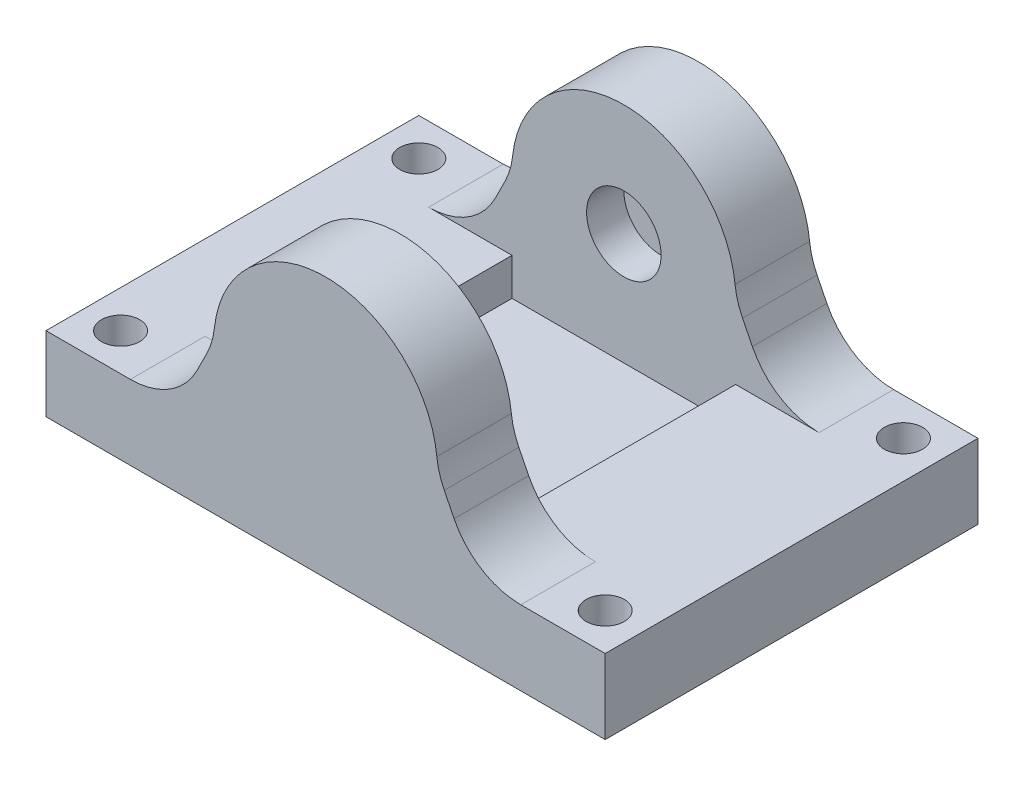
ISO-10303-21;
HEADER;
FILE_DESCRIPTION(('STEP AP214'),'2;1');
FILE_NAME('part.step','',(''),(''),'','','');
FILE_SCHEMA(('AUTOMOTIVE_DESIGN { 1 0 10303 214 1 1 1 1 }'));
ENDSEC;
DATA;
#1=APPLICATION_CONTEXT('core data for automotive mechanical design processes');
#2=APPLICATION_PROTOCOL_DEFINITION('international standard','automotive_design',2000,#1);
#3=PRODUCT_CONTEXT('',#1,'mechanical');
#4=PRODUCT('Part','Part','',(#3));
#5=PRODUCT_RELATED_PRODUCT_CATEGORY('part','',(#4));
#6=PRODUCT_DEFINITION_FORMATION('','',#4);
#7=PRODUCT_DEFINITION_CONTEXT('part definition',#1,'design');
#8=PRODUCT_DEFINITION('design','',#6,#7);
#9=PRODUCT_DEFINITION_SHAPE('','',#8);
#10=(LENGTH_UNIT() NAMED_UNIT(*) SI_UNIT(.MILLI.,.METRE.));
#11=(NAMED_UNIT(*) PLANE_ANGLE_UNIT() SI_UNIT($,.RADIAN.));
#12=(NAMED_UNIT(*) SI_UNIT($,.STERADIAN.) SOLID_ANGLE_UNIT());
#13=UNCERTAINTY_MEASURE_WITH_UNIT(LENGTH_MEASURE(1.E-05),#10,'distance_accuracy_value','');
#14=(GEOMETRIC_REPRESENTATION_CONTEXT(3) GLOBAL_UNCERTAINTY_ASSIGNED_CONTEXT((#13)) GLOBAL_UNIT_ASSIGNED_CONTEXT((#10,
#11,#12)) REPRESENTATION_CONTEXT('',''));
#15=CARTESIAN_POINT('',(0.,0.,0.));
#16=DIRECTION('',(0.,0.,1.));
#17=DIRECTION('',(1.,0.,0.));
#18=AXIS2_PLACEMENT_3D('',#15,#16,#17);
#19=CARTESIAN_POINT('',(0.,10.,0.));
#20=DIRECTION('',(0.,1.,0.));
#21=DIRECTION('',(0.,0.,1.));
#22=AXIS2_PLACEMENT_3D('',#19,#20,#21);
#23=PLANE('',#22);
#24=DIRECTION('',(0.,0.,1.));
#25=VECTOR('',#24,1.);
#26=CARTESIAN_POINT('',(22.5,10.,-40.));
#27=LINE('',#26,#25);
#28=CARTESIAN_POINT('',(22.5,10.,-40.));
#29=VERTEX_POINT('',#28);
#30=CARTESIAN_POINT('',(22.5,10.,-10.));
#31=VERTEX_POINT('',#30);
#32=EDGE_CURVE('E205',#29,#31,#27,.T.);
#33=ORIENTED_EDGE('',*,*,#32,.F.);
#34=DIRECTION('',(1.,0.,0.));
#35=VECTOR('',#34,1.);
#36=CARTESIAN_POINT('',(17.5,10.,-40.));
#37=LINE('',#36,#35);
#38=CARTESIAN_POINT('',(11.319660112501,10.,-40.));
#39=VERTEX_POINT('',#38);
#40=EDGE_CURVE('E272',#39,#29,#37,.T.);
#41=ORIENTED_EDGE('',*,*,#40,.F.);
#42=DIRECTION('',(0.,0.,-1.));
#43=VECTOR('',#42,1.);
#44=CARTESIAN_POINT('',(11.319660112501,10.,0.));
#45=LINE('',#44,#43);
#46=CARTESIAN_POINT('',(11.319660112501,10.,-50.));
#47=VERTEX_POINT('',#46);
#48=EDGE_CURVE('E387',#39,#47,#45,.T.);
#49=ORIENTED_EDGE('',*,*,#48,.T.);
#50=DIRECTION('',(1.,0.,0.));
#51=VECTOR('',#50,1.);
#52=CARTESIAN_POINT('',(0.,10.,-50.));
#53=LINE('',#52,#51);
#54=CARTESIAN_POINT('',(0.,10.,-50.));
#55=VERTEX_POINT('',#54);
#56=EDGE_CURVE('E320',#55,#47,#53,.T.);
#57=ORIENTED_EDGE('',*,*,#56,.F.);
#58=DIRECTION('',(0.,0.,-1.));
#59=VECTOR('',#58,1.);
#60=CARTESIAN_POINT('',(0.,10.,0.));
#61=LINE('',#60,#59);
#62=CARTESIAN_POINT('',(0.,10.,0.));
#63=VERTEX_POINT('',#62);
#64=EDGE_CURVE('E323',#63,#55,#61,.T.);
#65=ORIENTED_EDGE('',*,*,#64,.F.);
#66=DIRECTION('',(1.,0.,0.));
#67=VECTOR('',#66,1.);
#68=CARTESIAN_POINT('',(0.,10.,0.));
#69=LINE('',#68,#67);
#70=CARTESIAN_POINT('',(11.319660112501,10.,0.));
#71=VERTEX_POINT('',#70);
#72=EDGE_CURVE('E312',#63,#71,#69,.T.);
#73=ORIENTED_EDGE('',*,*,#72,.T.);
#74=DIRECTION('',(0.,0.,1.));
#75=VECTOR('',#74,1.);
#76=CARTESIAN_POINT('',(11.319660112501,10.,-10.));
#77=LINE('',#76,#75);
#78=CARTESIAN_POINT('',(11.319660112501,10.,-10.));
#79=VERTEX_POINT('',#78);
#80=EDGE_CURVE('E354',#71,#79,#77,.F.);
#81=ORIENTED_EDGE('',*,*,#80,.T.);
#82=DIRECTION('',(1.,0.,0.));
#83=VECTOR('',#82,1.);
#84=CARTESIAN_POINT('',(17.5,10.,-10.));
#85=LINE('',#84,#83);
#86=EDGE_CURVE('E299',#79,#31,#85,.T.);
#87=ORIENTED_EDGE('',*,*,#86,.T.);
#88=EDGE_LOOP('',(#33,#41,#49,#57,#65,#73,#81,#87));
#89=FACE_BOUND('',#88,.T.);
#90=CARTESIAN_POINT('',(5.,10.,-5.));
#91=DIRECTION('',(0.,1.,0.));
#92=DIRECTION('',(0.,0.,1.));
#93=AXIS2_PLACEMENT_3D('',#90,#91,#92);
#94=CIRCLE('',#93,2.5625);
#95=CARTESIAN_POINT('',(5.,10.,-2.4375));
#96=VERTEX_POINT('',#95);
#97=EDGE_CURVE('E250',#96,#96,#94,.T.);
#98=ORIENTED_EDGE('',*,*,#97,.F.);
#99=EDGE_LOOP('',(#98));
#100=FACE_BOUND('',#99,.T.);
#101=CARTESIAN_POINT('',(5.,10.,-45.));
#102=DIRECTION('',(0.,-1.,0.));
#103=DIRECTION('',(0.,0.,-1.));
#104=AXIS2_PLACEMENT_3D('',#101,#102,#103);
#105=CIRCLE('',#104,2.5625);
#106=CARTESIAN_POINT('',(5.,10.,-47.5625));
#107=VERTEX_POINT('',#106);
#108=EDGE_CURVE('E244',#107,#107,#105,.T.);
#109=ORIENTED_EDGE('',*,*,#108,.T.);
#110=EDGE_LOOP('',(#109));
#111=FACE_BOUND('',#110,.T.);
#112=ADVANCED_FACE('F36',(#89,#100,#111),#23,.T.);
#113=DIRECTION('',(0.,0.,-1.));
#114=VECTOR('',#113,1.);
#115=CARTESIAN_POINT('',(52.5,10.,-40.));
#116=LINE('',#115,#114);
#117=CARTESIAN_POINT('',(52.5,10.,-10.));
#118=VERTEX_POINT('',#117);
#119=CARTESIAN_POINT('',(52.5,10.,-40.));
#120=VERTEX_POINT('',#119);
#121=EDGE_CURVE('E51',#118,#120,#116,.T.);
#122=ORIENTED_EDGE('',*,*,#121,.F.);
#123=CARTESIAN_POINT('',(63.680339887499,10.,-10.));
#124=VERTEX_POINT('',#123);
#125=EDGE_CURVE('E298',#118,#124,#85,.T.);
#126=ORIENTED_EDGE('',*,*,#125,.T.);
#127=DIRECTION('',(0.,0.,1.));
#128=VECTOR('',#127,1.);
#129=CARTESIAN_POINT('',(63.680339887499,10.,0.));
#130=LINE('',#129,#128);
#131=CARTESIAN_POINT('',(63.680339887499,10.,0.));
#132=VERTEX_POINT('',#131);
#133=EDGE_CURVE('E351',#124,#132,#130,.T.);
#134=ORIENTED_EDGE('',*,*,#133,.T.);
#135=CARTESIAN_POINT('',(75.,10.,0.));
#136=VERTEX_POINT('',#135);
#137=EDGE_CURVE('E316',#132,#136,#69,.T.);
#138=ORIENTED_EDGE('',*,*,#137,.T.);
#139=DIRECTION('',(0.,0.,-1.));
#140=VECTOR('',#139,1.);
#141=CARTESIAN_POINT('',(75.,10.,0.));
#142=LINE('',#141,#140);
#143=CARTESIAN_POINT('',(75.,10.,-50.));
#144=VERTEX_POINT('',#143);
#145=EDGE_CURVE('E315',#136,#144,#142,.T.);
#146=ORIENTED_EDGE('',*,*,#145,.T.);
#147=CARTESIAN_POINT('',(63.6803398874989,10.,-50.));
#148=VERTEX_POINT('',#147);
#149=EDGE_CURVE('E319',#148,#144,#53,.T.);
#150=ORIENTED_EDGE('',*,*,#149,.F.);
#151=DIRECTION('',(0.,0.,-1.));
#152=VECTOR('',#151,1.);
#153=CARTESIAN_POINT('',(63.6803398874989,10.,0.));
#154=LINE('',#153,#152);
#155=CARTESIAN_POINT('',(63.6803398874989,10.,-40.));
#156=VERTEX_POINT('',#155);
#157=EDGE_CURVE('E384',#148,#156,#154,.F.);
#158=ORIENTED_EDGE('',*,*,#157,.T.);
#159=EDGE_CURVE('E271',#120,#156,#37,.T.);
#160=ORIENTED_EDGE('',*,*,#159,.F.);
#161=EDGE_LOOP('',(#122,#126,#134,#138,#146,#150,#158,#160));
#162=FACE_BOUND('',#161,.T.);
#163=CARTESIAN_POINT('',(70.,10.,-45.));
#164=DIRECTION('',(0.,1.,0.));
#165=DIRECTION('',(0.,0.,-1.));
#166=AXIS2_PLACEMENT_3D('',#163,#164,#165);
#167=CIRCLE('',#166,2.5625);
#168=CARTESIAN_POINT('',(70.,10.,-47.5625));
#169=VERTEX_POINT('',#168);
#170=EDGE_CURVE('E231',#169,#169,#167,.T.);
#171=ORIENTED_EDGE('',*,*,#170,.F.);
#172=EDGE_LOOP('',(#171));
#173=FACE_BOUND('',#172,.T.);
#174=CARTESIAN_POINT('',(70.,10.,-5.));
#175=DIRECTION('',(0.,-1.,0.));
#176=DIRECTION('',(0.,0.,1.));
#177=AXIS2_PLACEMENT_3D('',#174,#175,#176);
#178=CIRCLE('',#177,2.5625);
#179=CARTESIAN_POINT('',(70.,10.,-2.4375));
#180=VERTEX_POINT('',#179);
#181=EDGE_CURVE('E238',#180,#180,#178,.T.);
#182=ORIENTED_EDGE('',*,*,#181,.T.);
#183=EDGE_LOOP('',(#182));
#184=FACE_BOUND('',#183,.T.);
#185=ADVANCED_FACE('F477',(#162,#173,#184),#23,.T.);
#186=CARTESIAN_POINT('',(0.,10.,0.));
#187=DIRECTION('',(0.,0.,-1.));
#188=DIRECTION('',(-1.,0.,0.));
#189=AXIS2_PLACEMENT_3D('',#186,#187,#188);
#190=PLANE('',#189);
#191=DIRECTION('',(1.,0.,0.));
#192=VECTOR('',#191,1.);
#193=CARTESIAN_POINT('',(0.,0.,0.));
#194=LINE('',#193,#192);
#195=CARTESIAN_POINT('',(0.,0.,0.));
#196=VERTEX_POINT('',#195);
#197=CARTESIAN_POINT('',(75.,0.,0.));
#198=VERTEX_POINT('',#197);
#199=EDGE_CURVE('E304',#196,#198,#194,.T.);
#200=ORIENTED_EDGE('',*,*,#199,.T.);
#201=DIRECTION('',(0.,-1.,0.));
#202=VECTOR('',#201,1.);
#203=CARTESIAN_POINT('',(75.,10.,0.));
#204=LINE('',#203,#202);
#205=EDGE_CURVE('E343',#136,#198,#204,.T.);
#206=ORIENTED_EDGE('',*,*,#205,.F.);
#207=ORIENTED_EDGE('',*,*,#137,.F.);
#208=CARTESIAN_POINT('',(63.680339887499,20.,0.));
#209=DIRECTION('',(0.,0.,-1.));
#210=DIRECTION('',(-1.,0.,0.));
#211=AXIS2_PLACEMENT_3D('',#208,#209,#210);
#212=CIRCLE('',#211,10.);
#213=CARTESIAN_POINT('',(54.7360679774998,15.5278640450004,0.));
#214=VERTEX_POINT('',#213);
#215=EDGE_CURVE('E371',#132,#214,#212,.T.);
#216=ORIENTED_EDGE('',*,*,#215,.T.);
#217=DIRECTION('',(-0.447213595499958,0.894427190999916,0.));
#218=VECTOR('',#217,1.);
#219=CARTESIAN_POINT('',(52.5,20.,0.));
#220=LINE('',#219,#218);
#221=CARTESIAN_POINT('',(53.4159122232253,18.1681755535495,0.));
#222=VERTEX_POINT('',#221);
#223=EDGE_CURVE('E295',#214,#222,#220,.T.);
#224=ORIENTED_EDGE('',*,*,#223,.T.);
#225=CARTESIAN_POINT('',(62.3601841332244,22.640311508549,0.));
#226=DIRECTION('',(0.,0.,-1.));
#227=DIRECTION('',(-1.,0.,0.));
#228=AXIS2_PLACEMENT_3D('',#225,#226,#227);
#229=CIRCLE('',#228,10.);
#230=CARTESIAN_POINT('',(52.4161104799347,21.5841869051294,0.));
#231=VERTEX_POINT('',#230);
#232=EDGE_CURVE('E380',#222,#231,#229,.T.);
#233=ORIENTED_EDGE('',*,*,#232,.T.);
#234=CARTESIAN_POINT('',(37.5,20.,0.));
#235=DIRECTION('',(0.,0.,1.));
#236=DIRECTION('',(1.,0.,0.));
#237=AXIS2_PLACEMENT_3D('',#234,#235,#236);
#238=CIRCLE('',#237,15.);
#239=CARTESIAN_POINT('',(22.5838895200653,21.5841869051294,0.));
#240=VERTEX_POINT('',#239);
#241=EDGE_CURVE('E288',#231,#240,#238,.T.);
#242=ORIENTED_EDGE('',*,*,#241,.T.);
#243=CARTESIAN_POINT('',(12.6398158667756,22.6403115085491,0.));
#244=DIRECTION('',(0.,0.,-1.));
#245=DIRECTION('',(-1.,0.,0.));
#246=AXIS2_PLACEMENT_3D('',#243,#244,#245);
#247=CIRCLE('',#246,10.);
#248=CARTESIAN_POINT('',(21.5840877767747,18.1681755535495,0.));
#249=VERTEX_POINT('',#248);
#250=EDGE_CURVE('E376',#240,#249,#247,.T.);
#251=ORIENTED_EDGE('',*,*,#250,.T.);
#252=DIRECTION('',(-0.447213595499958,-0.894427190999916,0.));
#253=VECTOR('',#252,1.);
#254=CARTESIAN_POINT('',(22.5,20.,0.));
#255=LINE('',#254,#253);
#256=CARTESIAN_POINT('',(20.2639320225002,15.5278640450004,0.));
#257=VERTEX_POINT('',#256);
#258=EDGE_CURVE('E307',#249,#257,#255,.T.);
#259=ORIENTED_EDGE('',*,*,#258,.T.);
#260=CARTESIAN_POINT('',(11.319660112501,20.,0.));
#261=DIRECTION('',(0.,0.,-1.));
#262=DIRECTION('',(-1.,0.,0.));
#263=AXIS2_PLACEMENT_3D('',#260,#261,#262);
#264=CIRCLE('',#263,10.);
#265=EDGE_CURVE('E367',#257,#71,#264,.T.);
#266=ORIENTED_EDGE('',*,*,#265,.T.);
#267=ORIENTED_EDGE('',*,*,#72,.F.);
#268=DIRECTION('',(0.,-1.,0.));
#269=VECTOR('',#268,1.);
#270=CARTESIAN_POINT('',(0.,10.,0.));
#271=LINE('',#270,#269);
#272=EDGE_CURVE('E326',#63,#196,#271,.T.);
#273=ORIENTED_EDGE('',*,*,#272,.T.);
#274=EDGE_LOOP('',(#200,#206,#207,#216,#224,#233,#242,#251,#259,#266,#267,#273));
#275=FACE_BOUND('',#274,.T.);
#276=ADVANCED_FACE('F461',(#275),#190,.F.);
#277=CARTESIAN_POINT('',(75.,10.,0.));
#278=DIRECTION('',(-1.,0.,0.));
#279=DIRECTION('',(0.,0.,1.));
#280=AXIS2_PLACEMENT_3D('',#277,#278,#279);
#281=PLANE('',#280);
#282=DIRECTION('',(0.,0.,-1.));
#283=VECTOR('',#282,1.);
#284=CARTESIAN_POINT('',(75.,0.,0.));
#285=LINE('',#284,#283);
#286=CARTESIAN_POINT('',(75.,0.,-50.));
#287=VERTEX_POINT('',#286);
#288=EDGE_CURVE('E329',#198,#287,#285,.T.);
#289=ORIENTED_EDGE('',*,*,#288,.T.);
#290=DIRECTION('',(0.,-1.,0.));
#291=VECTOR('',#290,1.);
#292=CARTESIAN_POINT('',(75.,10.,-50.));
#293=LINE('',#292,#291);
#294=EDGE_CURVE('E341',#144,#287,#293,.T.);
#295=ORIENTED_EDGE('',*,*,#294,.F.);
#296=ORIENTED_EDGE('',*,*,#145,.F.);
#297=ORIENTED_EDGE('',*,*,#205,.T.);
#298=EDGE_LOOP('',(#289,#295,#296,#297));
#299=FACE_BOUND('',#298,.T.);
#300=ADVANCED_FACE('F473',(#299),#281,.F.);
#301=CARTESIAN_POINT('',(0.,10.,-50.));
#302=DIRECTION('',(0.,0.,-1.));
#303=DIRECTION('',(-1.,0.,0.));
#304=AXIS2_PLACEMENT_3D('',#301,#302,#303);
#305=PLANE('',#304);
#306=DIRECTION('',(1.,0.,0.));
#307=VECTOR('',#306,1.);
#308=CARTESIAN_POINT('',(0.,0.,-50.));
#309=LINE('',#308,#307);
#310=CARTESIAN_POINT('',(0.,0.,-50.));
#311=VERTEX_POINT('',#310);
#312=EDGE_CURVE('E332',#311,#287,#309,.T.);
#313=ORIENTED_EDGE('',*,*,#312,.F.);
#314=DIRECTION('',(0.,-1.,0.));
#315=VECTOR('',#314,1.);
#316=CARTESIAN_POINT('',(0.,10.,-50.));
#317=LINE('',#316,#315);
#318=EDGE_CURVE('E339',#55,#311,#317,.T.);
#319=ORIENTED_EDGE('',*,*,#318,.F.);
#320=ORIENTED_EDGE('',*,*,#56,.T.);
#321=CARTESIAN_POINT('',(11.319660112501,20.,-50.));
#322=DIRECTION('',(0.,0.,-1.));
#323=DIRECTION('',(-1.,0.,0.));
#324=AXIS2_PLACEMENT_3D('',#321,#322,#323);
#325=CIRCLE('',#324,10.);
#326=CARTESIAN_POINT('',(20.2639320225002,15.5278640450004,-50.));
#327=VERTEX_POINT('',#326);
#328=EDGE_CURVE('E404',#47,#327,#325,.F.);
#329=ORIENTED_EDGE('',*,*,#328,.T.);
#330=DIRECTION('',(-0.447213595499958,-0.894427190999916,0.));
#331=VECTOR('',#330,1.);
#332=CARTESIAN_POINT('',(22.5,20.,-50.));
#333=LINE('',#332,#331);
#334=CARTESIAN_POINT('',(21.5840877767747,18.1681755535495,-50.));
#335=VERTEX_POINT('',#334);
#336=EDGE_CURVE('E268',#335,#327,#333,.T.);
#337=ORIENTED_EDGE('',*,*,#336,.F.);
#338=CARTESIAN_POINT('',(12.6398158667756,22.6403115085491,-50.));
#339=DIRECTION('',(0.,0.,-1.));
#340=DIRECTION('',(-1.,0.,0.));
#341=AXIS2_PLACEMENT_3D('',#338,#339,#340);
#342=CIRCLE('',#341,10.);
#343=CARTESIAN_POINT('',(22.5838895200653,21.5841869051294,-50.));
#344=VERTEX_POINT('',#343);
#345=EDGE_CURVE('E413',#335,#344,#342,.F.);
#346=ORIENTED_EDGE('',*,*,#345,.T.);
#347=CARTESIAN_POINT('',(37.5,20.,-50.));
#348=DIRECTION('',(0.,0.,1.));
#349=DIRECTION('',(1.,0.,0.));
#350=AXIS2_PLACEMENT_3D('',#347,#348,#349);
#351=CIRCLE('',#350,15.);
#352=CARTESIAN_POINT('',(52.4161104799347,21.5841869051294,-50.));
#353=VERTEX_POINT('',#352);
#354=EDGE_CURVE('E262',#353,#344,#351,.T.);
#355=ORIENTED_EDGE('',*,*,#354,.F.);
#356=CARTESIAN_POINT('',(62.3601841332244,22.640311508549,-50.));
#357=DIRECTION('',(0.,0.,-1.));
#358=DIRECTION('',(-1.,0.,0.));
#359=AXIS2_PLACEMENT_3D('',#356,#357,#358);
#360=CIRCLE('',#359,10.);
#361=CARTESIAN_POINT('',(53.4159122232253,18.1681755535495,-50.));
#362=VERTEX_POINT('',#361);
#363=EDGE_CURVE('E44',#353,#362,#360,.F.);
#364=ORIENTED_EDGE('',*,*,#363,.T.);
#365=DIRECTION('',(-0.447213595499958,0.894427190999916,0.));
#366=VECTOR('',#365,1.);
#367=CARTESIAN_POINT('',(52.5,20.,-50.));
#368=LINE('',#367,#366);
#369=CARTESIAN_POINT('',(54.7360679774998,15.5278640450004,-50.));
#370=VERTEX_POINT('',#369);
#371=EDGE_CURVE('E280',#370,#362,#368,.T.);
#372=ORIENTED_EDGE('',*,*,#371,.F.);
#373=CARTESIAN_POINT('',(63.6803398874989,20.,-50.));
#374=DIRECTION('',(0.,0.,-1.));
#375=DIRECTION('',(-1.,0.,0.));
#376=AXIS2_PLACEMENT_3D('',#373,#374,#375);
#377=CIRCLE('',#376,10.);
#378=EDGE_CURVE('E409',#370,#148,#377,.F.);
#379=ORIENTED_EDGE('',*,*,#378,.T.);
#380=ORIENTED_EDGE('',*,*,#149,.T.);
#381=ORIENTED_EDGE('',*,*,#294,.T.);
#382=EDGE_LOOP('',(#313,#319,#320,#329,#337,#346,#355,#364,#372,#379,#380,#381));
#383=FACE_BOUND('',#382,.T.);
#384=ADVANCED_FACE('F420',(#383),#305,.T.);
#385=CARTESIAN_POINT('',(0.,10.,0.));
#386=DIRECTION('',(-1.,0.,0.));
#387=DIRECTION('',(0.,0.,1.));
#388=AXIS2_PLACEMENT_3D('',#385,#386,#387);
#389=PLANE('',#388);
#390=DIRECTION('',(0.,0.,-1.));
#391=VECTOR('',#390,1.);
#392=CARTESIAN_POINT('',(0.,0.,0.));
#393=LINE('',#392,#391);
#394=EDGE_CURVE('E335',#196,#311,#393,.T.);
#395=ORIENTED_EDGE('',*,*,#394,.F.);
#396=ORIENTED_EDGE('',*,*,#272,.F.);
#397=ORIENTED_EDGE('',*,*,#64,.T.);
#398=ORIENTED_EDGE('',*,*,#318,.T.);
#399=EDGE_LOOP('',(#395,#396,#397,#398));
#400=FACE_BOUND('',#399,.T.);
#401=ADVANCED_FACE('F465',(#400),#389,.T.);
#402=CARTESIAN_POINT('',(0.,0.,0.));
#403=DIRECTION('',(0.,1.,0.));
#404=DIRECTION('',(0.,0.,1.));
#405=AXIS2_PLACEMENT_3D('',#402,#403,#404);
#406=PLANE('',#405);
#407=CARTESIAN_POINT('',(70.,0.,-45.));
#408=DIRECTION('',(0.,1.,0.));
#409=DIRECTION('',(0.,0.,-1.));
#410=AXIS2_PLACEMENT_3D('',#407,#408,#409);
#411=CIRCLE('',#410,2.5625);
#412=CARTESIAN_POINT('',(70.,0.,-47.5625));
#413=VERTEX_POINT('',#412);
#414=EDGE_CURVE('E235',#413,#413,#411,.T.);
#415=ORIENTED_EDGE('',*,*,#414,.T.);
#416=EDGE_LOOP('',(#415));
#417=FACE_BOUND('',#416,.T.);
#418=CARTESIAN_POINT('',(70.,0.,-5.));
#419=DIRECTION('',(0.,-1.,0.));
#420=DIRECTION('',(0.,0.,1.));
#421=AXIS2_PLACEMENT_3D('',#418,#419,#420);
#422=CIRCLE('',#421,2.5625);
#423=CARTESIAN_POINT('',(70.,0.,-2.4375));
#424=VERTEX_POINT('',#423);
#425=EDGE_CURVE('E241',#424,#424,#422,.T.);
#426=ORIENTED_EDGE('',*,*,#425,.F.);
#427=EDGE_LOOP('',(#426));
#428=FACE_BOUND('',#427,.T.);
#429=CARTESIAN_POINT('',(5.,0.,-45.));
#430=DIRECTION('',(0.,-1.,0.));
#431=DIRECTION('',(0.,0.,-1.));
#432=AXIS2_PLACEMENT_3D('',#429,#430,#431);
#433=CIRCLE('',#432,2.5625);
#434=CARTESIAN_POINT('',(5.,0.,-47.5625));
#435=VERTEX_POINT('',#434);
#436=EDGE_CURVE('E247',#435,#435,#433,.T.);
#437=ORIENTED_EDGE('',*,*,#436,.F.);
#438=EDGE_LOOP('',(#437));
#439=FACE_BOUND('',#438,.T.);
#440=CARTESIAN_POINT('',(5.,0.,-5.));
#441=DIRECTION('',(0.,1.,0.));
#442=DIRECTION('',(0.,0.,1.));
#443=AXIS2_PLACEMENT_3D('',#440,#441,#442);
#444=CIRCLE('',#443,2.5625);
#445=CARTESIAN_POINT('',(5.,0.,-2.4375));
#446=VERTEX_POINT('',#445);
#447=EDGE_CURVE('E253',#446,#446,#444,.T.);
#448=ORIENTED_EDGE('',*,*,#447,.T.);
#449=EDGE_LOOP('',(#448));
#450=FACE_BOUND('',#449,.T.);
#451=ORIENTED_EDGE('',*,*,#199,.F.);
#452=ORIENTED_EDGE('',*,*,#394,.T.);
#453=ORIENTED_EDGE('',*,*,#312,.T.);
#454=ORIENTED_EDGE('',*,*,#288,.F.);
#455=EDGE_LOOP('',(#451,#452,#453,#454));
#456=FACE_BOUND('',#455,.T.);
#457=ADVANCED_FACE('F469',(#417,#428,#439,#450,#456),#406,.F.);
#458=CARTESIAN_POINT('',(37.5,20.,-10.));
#459=DIRECTION('',(0.,0.,1.));
#460=DIRECTION('',(1.,0.,0.));
#461=AXIS2_PLACEMENT_3D('',#458,#459,#460);
#462=CYLINDRICAL_SURFACE('',#461,15.);
#463=CARTESIAN_POINT('',(37.5,20.,-10.));
#464=DIRECTION('',(0.,0.,1.));
#465=DIRECTION('',(1.,0.,0.));
#466=AXIS2_PLACEMENT_3D('',#463,#464,#465);
#467=CIRCLE('',#466,15.);
#468=CARTESIAN_POINT('',(52.4161104799347,21.5841869051294,-10.));
#469=VERTEX_POINT('',#468);
#470=CARTESIAN_POINT('',(22.5838895200653,21.5841869051294,-10.));
#471=VERTEX_POINT('',#470);
#472=EDGE_CURVE('E291',#469,#471,#467,.T.);
#473=ORIENTED_EDGE('',*,*,#472,.T.);
#474=DIRECTION('',(0.,0.,1.));
#475=VECTOR('',#474,1.);
#476=CARTESIAN_POINT('',(22.5838895200653,21.5841869051294,-10.));
#477=LINE('',#476,#475);
#478=EDGE_CURVE('E364',#471,#240,#477,.T.);
#479=ORIENTED_EDGE('',*,*,#478,.T.);
#480=ORIENTED_EDGE('',*,*,#241,.F.);
#481=DIRECTION('',(0.,0.,1.));
#482=VECTOR('',#481,1.);
#483=CARTESIAN_POINT('',(52.4161104799347,21.5841869051294,-10.));
#484=LINE('',#483,#482);
#485=EDGE_CURVE('E362',#231,#469,#484,.F.);
#486=ORIENTED_EDGE('',*,*,#485,.T.);
#487=EDGE_LOOP('',(#473,#479,#480,#486));
#488=FACE_BOUND('',#487,.T.);
#489=ADVANCED_FACE('F495',(#488),#462,.T.);
#490=CARTESIAN_POINT('',(52.5,20.,-10.));
#491=DIRECTION('',(0.894427190999916,0.447213595499958,0.));
#492=DIRECTION('',(-0.447213595499958,0.894427190999916,0.));
#493=AXIS2_PLACEMENT_3D('',#490,#491,#492);
#494=PLANE('',#493);
#495=ORIENTED_EDGE('',*,*,#223,.F.);
#496=DIRECTION('',(0.,0.,1.));
#497=VECTOR('',#496,1.);
#498=CARTESIAN_POINT('',(54.7360679774998,15.5278640450004,-10.));
#499=LINE('',#498,#497);
#500=CARTESIAN_POINT('',(54.7360679774998,15.5278640450004,-10.));
#501=VERTEX_POINT('',#500);
#502=EDGE_CURVE('E360',#214,#501,#499,.F.);
#503=ORIENTED_EDGE('',*,*,#502,.T.);
#504=DIRECTION('',(-0.447213595499958,0.894427190999916,0.));
#505=VECTOR('',#504,1.);
#506=CARTESIAN_POINT('',(52.5,20.,-10.));
#507=LINE('',#506,#505);
#508=CARTESIAN_POINT('',(53.4159122232253,18.1681755535495,-10.));
#509=VERTEX_POINT('',#508);
#510=EDGE_CURVE('E301',#501,#509,#507,.T.);
#511=ORIENTED_EDGE('',*,*,#510,.T.);
#512=DIRECTION('',(0.,0.,-1.));
#513=VECTOR('',#512,1.);
#514=CARTESIAN_POINT('',(53.4159122232253,18.1681755535495,0.));
#515=LINE('',#514,#513);
#516=EDGE_CURVE('E357',#509,#222,#515,.F.);
#517=ORIENTED_EDGE('',*,*,#516,.T.);
#518=EDGE_LOOP('',(#495,#503,#511,#517));
#519=FACE_BOUND('',#518,.T.);
#520=ADVANCED_FACE('F487',(#519),#494,.T.);
#521=CARTESIAN_POINT('',(22.5,20.,-10.));
#522=DIRECTION('',(-0.894427190999916,0.447213595499958,0.));
#523=DIRECTION('',(-0.447213595499958,-0.894427190999916,0.));
#524=AXIS2_PLACEMENT_3D('',#521,#522,#523);
#525=PLANE('',#524);
#526=DIRECTION('',(-0.447213595499958,-0.894427190999916,0.));
#527=VECTOR('',#526,1.);
#528=CARTESIAN_POINT('',(22.5,20.,-10.));
#529=LINE('',#528,#527);
#530=CARTESIAN_POINT('',(21.5840877767747,18.1681755535495,-10.));
#531=VERTEX_POINT('',#530);
#532=CARTESIAN_POINT('',(20.2639320225002,15.5278640450004,-10.));
#533=VERTEX_POINT('',#532);
#534=EDGE_CURVE('E294',#531,#533,#529,.T.);
#535=ORIENTED_EDGE('',*,*,#534,.T.);
#536=DIRECTION('',(0.,0.,1.));
#537=VECTOR('',#536,1.);
#538=CARTESIAN_POINT('',(20.2639320225002,15.5278640450004,0.));
#539=LINE('',#538,#537);
#540=EDGE_CURVE('E348',#533,#257,#539,.T.);
#541=ORIENTED_EDGE('',*,*,#540,.T.);
#542=ORIENTED_EDGE('',*,*,#258,.F.);
#543=DIRECTION('',(0.,0.,-1.));
#544=VECTOR('',#543,1.);
#545=CARTESIAN_POINT('',(21.5840877767747,18.1681755535495,-10.));
#546=LINE('',#545,#544);
#547=EDGE_CURVE('E346',#249,#531,#546,.T.);
#548=ORIENTED_EDGE('',*,*,#547,.T.);
#549=EDGE_LOOP('',(#535,#541,#542,#548));
#550=FACE_BOUND('',#549,.T.);
#551=ADVANCED_FACE('F455',(#550),#525,.T.);
#552=CARTESIAN_POINT('',(37.5,20.,-10.));
#553=DIRECTION('',(0.,0.,1.));
#554=DIRECTION('',(1.,0.,0.));
#555=AXIS2_PLACEMENT_3D('',#552,#553,#554);
#556=PLANE('',#555);
#557=CARTESIAN_POINT('',(37.5,20.,-10.));
#558=DIRECTION('',(0.,0.,-1.));
#559=DIRECTION('',(-1.,0.,0.));
#560=AXIS2_PLACEMENT_3D('',#557,#558,#559);
#561=CIRCLE('',#560,5.);
#562=CARTESIAN_POINT('',(32.5,20.,-10.));
#563=VERTEX_POINT('',#562);
#564=EDGE_CURVE('E278',#563,#563,#561,.T.);
#565=ORIENTED_EDGE('',*,*,#564,.F.);
#566=EDGE_LOOP('',(#565));
#567=FACE_BOUND('',#566,.T.);
#568=ORIENTED_EDGE('',*,*,#472,.F.);
#569=CARTESIAN_POINT('',(62.3601841332244,22.640311508549,-10.));
#570=DIRECTION('',(0.,0.,1.));
#571=DIRECTION('',(1.,0.,0.));
#572=AXIS2_PLACEMENT_3D('',#569,#570,#571);
#573=CIRCLE('',#572,10.);
#574=EDGE_CURVE('E382',#469,#509,#573,.T.);
#575=ORIENTED_EDGE('',*,*,#574,.T.);
#576=ORIENTED_EDGE('',*,*,#510,.F.);
#577=CARTESIAN_POINT('',(63.680339887499,20.,-10.));
#578=DIRECTION('',(0.,0.,1.));
#579=DIRECTION('',(1.,0.,0.));
#580=AXIS2_PLACEMENT_3D('',#577,#578,#579);
#581=CIRCLE('',#580,10.);
#582=EDGE_CURVE('E373',#501,#124,#581,.T.);
#583=ORIENTED_EDGE('',*,*,#582,.T.);
#584=ORIENTED_EDGE('',*,*,#125,.F.);
#585=DIRECTION('',(0.,1.,0.));
#586=VECTOR('',#585,1.);
#587=CARTESIAN_POINT('',(52.5,5.,-10.));
#588=LINE('',#587,#586);
#589=CARTESIAN_POINT('',(52.5,5.,-10.));
#590=VERTEX_POINT('',#589);
#591=EDGE_CURVE('E208',#590,#118,#588,.T.);
#592=ORIENTED_EDGE('',*,*,#591,.F.);
#593=DIRECTION('',(1.,0.,0.));
#594=VECTOR('',#593,1.);
#595=CARTESIAN_POINT('',(22.5,5.,-10.));
#596=LINE('',#595,#594);
#597=CARTESIAN_POINT('',(22.5,5.,-10.));
#598=VERTEX_POINT('',#597);
#599=EDGE_CURVE('E212',#598,#590,#596,.T.);
#600=ORIENTED_EDGE('',*,*,#599,.F.);
#601=DIRECTION('',(0.,1.,0.));
#602=VECTOR('',#601,1.);
#603=CARTESIAN_POINT('',(22.5,5.,-10.));
#604=LINE('',#603,#602);
#605=EDGE_CURVE('E198',#598,#31,#604,.T.);
#606=ORIENTED_EDGE('',*,*,#605,.T.);
#607=ORIENTED_EDGE('',*,*,#86,.F.);
#608=CARTESIAN_POINT('',(11.319660112501,20.,-10.));
#609=DIRECTION('',(0.,0.,1.));
#610=DIRECTION('',(1.,0.,0.));
#611=AXIS2_PLACEMENT_3D('',#608,#609,#610);
#612=CIRCLE('',#611,10.);
#613=EDGE_CURVE('E369',#79,#533,#612,.T.);
#614=ORIENTED_EDGE('',*,*,#613,.T.);
#615=ORIENTED_EDGE('',*,*,#534,.F.);
#616=CARTESIAN_POINT('',(12.6398158667756,22.6403115085491,-10.));
#617=DIRECTION('',(0.,0.,1.));
#618=DIRECTION('',(1.,0.,0.));
#619=AXIS2_PLACEMENT_3D('',#616,#617,#618);
#620=CIRCLE('',#619,10.);
#621=EDGE_CURVE('E378',#531,#471,#620,.T.);
#622=ORIENTED_EDGE('',*,*,#621,.T.);
#623=EDGE_LOOP('',(#568,#575,#576,#583,#584,#592,#600,#606,#607,#614,#615,#622));
#624=FACE_BOUND('',#623,.T.);
#625=ADVANCED_FACE('F214',(#567,#624),#556,.F.);
#626=CARTESIAN_POINT('',(11.319660112501,20.,-10.));
#627=DIRECTION('',(0.,0.,-1.));
#628=DIRECTION('',(-1.,0.,0.));
#629=AXIS2_PLACEMENT_3D('',#626,#627,#628);
#630=CYLINDRICAL_SURFACE('',#629,10.);
#631=ORIENTED_EDGE('',*,*,#613,.F.);
#632=ORIENTED_EDGE('',*,*,#80,.F.);
#633=ORIENTED_EDGE('',*,*,#265,.F.);
#634=ORIENTED_EDGE('',*,*,#540,.F.);
#635=EDGE_LOOP('',(#631,#632,#633,#634));
#636=FACE_BOUND('',#635,.T.);
#637=ADVANCED_FACE('F458',(#636),#630,.F.);
#638=CARTESIAN_POINT('',(63.680339887499,20.,0.));
#639=DIRECTION('',(0.,0.,-1.));
#640=DIRECTION('',(-1.,0.,0.));
#641=AXIS2_PLACEMENT_3D('',#638,#639,#640);
#642=CYLINDRICAL_SURFACE('',#641,10.);
#643=ORIENTED_EDGE('',*,*,#582,.F.);
#644=ORIENTED_EDGE('',*,*,#502,.F.);
#645=ORIENTED_EDGE('',*,*,#215,.F.);
#646=ORIENTED_EDGE('',*,*,#133,.F.);
#647=EDGE_LOOP('',(#643,#644,#645,#646));
#648=FACE_BOUND('',#647,.T.);
#649=ADVANCED_FACE('F483',(#648),#642,.F.);
#650=CARTESIAN_POINT('',(12.6398158667756,22.6403115085491,-10.));
#651=DIRECTION('',(0.,0.,1.));
#652=DIRECTION('',(1.,0.,0.));
#653=AXIS2_PLACEMENT_3D('',#650,#651,#652);
#654=CYLINDRICAL_SURFACE('',#653,10.);
#655=ORIENTED_EDGE('',*,*,#621,.F.);
#656=ORIENTED_EDGE('',*,*,#547,.F.);
#657=ORIENTED_EDGE('',*,*,#250,.F.);
#658=ORIENTED_EDGE('',*,*,#478,.F.);
#659=EDGE_LOOP('',(#655,#656,#657,#658));
#660=FACE_BOUND('',#659,.T.);
#661=ADVANCED_FACE('F498',(#660),#654,.F.);
#662=CARTESIAN_POINT('',(62.3601841332244,22.640311508549,-10.));
#663=DIRECTION('',(0.,0.,1.));
#664=DIRECTION('',(1.,0.,0.));
#665=AXIS2_PLACEMENT_3D('',#662,#663,#664);
#666=CYLINDRICAL_SURFACE('',#665,10.);
#667=ORIENTED_EDGE('',*,*,#574,.F.);
#668=ORIENTED_EDGE('',*,*,#485,.F.);
#669=ORIENTED_EDGE('',*,*,#232,.F.);
#670=ORIENTED_EDGE('',*,*,#516,.F.);
#671=EDGE_LOOP('',(#667,#668,#669,#670));
#672=FACE_BOUND('',#671,.T.);
#673=ADVANCED_FACE('F492',(#672),#666,.F.);
#674=CARTESIAN_POINT('',(37.5,20.,-5.));
#675=DIRECTION('',(0.,0.,-1.));
#676=DIRECTION('',(-1.,0.,0.));
#677=AXIS2_PLACEMENT_3D('',#674,#675,#676);
#678=CYLINDRICAL_SURFACE('',#677,5.);
#679=CARTESIAN_POINT('',(37.5,20.,-5.));
#680=DIRECTION('',(0.,0.,-1.));
#681=DIRECTION('',(-1.,0.,0.));
#682=AXIS2_PLACEMENT_3D('',#679,#680,#681);
#683=CIRCLE('',#682,5.);
#684=CARTESIAN_POINT('',(32.5,20.,-5.));
#685=VERTEX_POINT('',#684);
#686=EDGE_CURVE('E285',#685,#685,#683,.T.);
#687=ORIENTED_EDGE('',*,*,#686,.F.);
#688=EDGE_LOOP('',(#687));
#689=FACE_BOUND('',#688,.T.);
#690=ORIENTED_EDGE('',*,*,#564,.T.);
#691=EDGE_LOOP('',(#690));
#692=FACE_BOUND('',#691,.T.);
#693=ADVANCED_FACE('F505',(#689,#692),#678,.F.);
#694=CARTESIAN_POINT('',(37.5,20.,-5.));
#695=DIRECTION('',(0.,0.,-1.));
#696=DIRECTION('',(-1.,0.,0.));
#697=AXIS2_PLACEMENT_3D('',#694,#695,#696);
#698=PLANE('',#697);
#699=ORIENTED_EDGE('',*,*,#686,.T.);
#700=EDGE_LOOP('',(#699));
#701=FACE_BOUND('',#700,.T.);
#702=ADVANCED_FACE('F716',(#701),#698,.T.);
#703=CARTESIAN_POINT('',(37.5,20.,-40.));
#704=DIRECTION('',(0.,0.,-1.));
#705=DIRECTION('',(-1.,0.,0.));
#706=AXIS2_PLACEMENT_3D('',#703,#704,#705);
#707=CYLINDRICAL_SURFACE('',#706,15.);
#708=ORIENTED_EDGE('',*,*,#354,.T.);
#709=DIRECTION('',(0.,0.,-1.));
#710=VECTOR('',#709,1.);
#711=CARTESIAN_POINT('',(22.5838895200653,21.5841869051294,-40.));
#712=LINE('',#711,#710);
#713=CARTESIAN_POINT('',(22.5838895200653,21.5841869051294,-40.));
#714=VERTEX_POINT('',#713);
#715=EDGE_CURVE('E59',#344,#714,#712,.F.);
#716=ORIENTED_EDGE('',*,*,#715,.T.);
#717=CARTESIAN_POINT('',(37.5,20.,-40.));
#718=DIRECTION('',(0.,0.,1.));
#719=DIRECTION('',(1.,0.,0.));
#720=AXIS2_PLACEMENT_3D('',#717,#718,#719);
#721=CIRCLE('',#720,15.);
#722=CARTESIAN_POINT('',(52.4161104799347,21.5841869051294,-40.));
#723=VERTEX_POINT('',#722);
#724=EDGE_CURVE('E265',#723,#714,#721,.T.);
#725=ORIENTED_EDGE('',*,*,#724,.F.);
#726=DIRECTION('',(0.,0.,-1.));
#727=VECTOR('',#726,1.);
#728=CARTESIAN_POINT('',(52.4161104799347,21.5841869051294,-40.));
#729=LINE('',#728,#727);
#730=EDGE_CURVE('E400',#723,#353,#729,.T.);
#731=ORIENTED_EDGE('',*,*,#730,.T.);
#732=EDGE_LOOP('',(#708,#716,#725,#731));
#733=FACE_BOUND('',#732,.T.);
#734=ADVANCED_FACE('F432',(#733),#707,.T.);
#735=CARTESIAN_POINT('',(22.5,20.,-40.));
#736=DIRECTION('',(0.894427190999916,-0.447213595499958,0.));
#737=DIRECTION('',(0.447213595499958,0.894427190999916,0.));
#738=AXIS2_PLACEMENT_3D('',#735,#736,#737);
#739=PLANE('',#738);
#740=ORIENTED_EDGE('',*,*,#336,.T.);
#741=DIRECTION('',(0.,0.,-1.));
#742=VECTOR('',#741,1.);
#743=CARTESIAN_POINT('',(20.2639320225002,15.5278640450004,-40.));
#744=LINE('',#743,#742);
#745=CARTESIAN_POINT('',(20.2639320225002,15.5278640450004,-40.));
#746=VERTEX_POINT('',#745);
#747=EDGE_CURVE('E393',#327,#746,#744,.F.);
#748=ORIENTED_EDGE('',*,*,#747,.T.);
#749=DIRECTION('',(-0.447213595499958,-0.894427190999916,0.));
#750=VECTOR('',#749,1.);
#751=CARTESIAN_POINT('',(22.5,20.,-40.));
#752=LINE('',#751,#750);
#753=CARTESIAN_POINT('',(21.5840877767747,18.1681755535495,-40.));
#754=VERTEX_POINT('',#753);
#755=EDGE_CURVE('E275',#754,#746,#752,.T.);
#756=ORIENTED_EDGE('',*,*,#755,.F.);
#757=DIRECTION('',(0.,0.,1.));
#758=VECTOR('',#757,1.);
#759=CARTESIAN_POINT('',(21.5840877767747,18.1681755535495,-50.));
#760=LINE('',#759,#758);
#761=EDGE_CURVE('E390',#754,#335,#760,.F.);
#762=ORIENTED_EDGE('',*,*,#761,.T.);
#763=EDGE_LOOP('',(#740,#748,#756,#762));
#764=FACE_BOUND('',#763,.T.);
#765=ADVANCED_FACE('F439',(#764),#739,.F.);
#766=CARTESIAN_POINT('',(52.5,20.,-40.));
#767=DIRECTION('',(-0.894427190999916,-0.447213595499958,0.));
#768=DIRECTION('',(0.447213595499958,-0.894427190999916,0.));
#769=AXIS2_PLACEMENT_3D('',#766,#767,#768);
#770=PLANE('',#769);
#771=DIRECTION('',(-0.447213595499958,0.894427190999916,0.));
#772=VECTOR('',#771,1.);
#773=CARTESIAN_POINT('',(52.5,20.,-40.));
#774=LINE('',#773,#772);
#775=CARTESIAN_POINT('',(54.7360679774998,15.5278640450004,-40.));
#776=VERTEX_POINT('',#775);
#777=CARTESIAN_POINT('',(53.4159122232253,18.1681755535495,-40.));
#778=VERTEX_POINT('',#777);
#779=EDGE_CURVE('E267',#776,#778,#774,.T.);
#780=ORIENTED_EDGE('',*,*,#779,.F.);
#781=DIRECTION('',(0.,0.,-1.));
#782=VECTOR('',#781,1.);
#783=CARTESIAN_POINT('',(54.7360679774998,15.5278640450004,-40.));
#784=LINE('',#783,#782);
#785=EDGE_CURVE('E397',#776,#370,#784,.T.);
#786=ORIENTED_EDGE('',*,*,#785,.T.);
#787=ORIENTED_EDGE('',*,*,#371,.T.);
#788=DIRECTION('',(0.,0.,1.));
#789=VECTOR('',#788,1.);
#790=CARTESIAN_POINT('',(53.4159122232253,18.1681755535495,-40.));
#791=LINE('',#790,#789);
#792=EDGE_CURVE('E395',#362,#778,#791,.T.);
#793=ORIENTED_EDGE('',*,*,#792,.T.);
#794=EDGE_LOOP('',(#780,#786,#787,#793));
#795=FACE_BOUND('',#794,.T.);
#796=ADVANCED_FACE('F426',(#795),#770,.F.);
#797=CARTESIAN_POINT('',(37.5,20.,-40.));
#798=DIRECTION('',(0.,0.,-1.));
#799=DIRECTION('',(1.,0.,0.));
#800=AXIS2_PLACEMENT_3D('',#797,#798,#799);
#801=PLANE('',#800);
#802=CARTESIAN_POINT('',(37.5,20.,-40.));
#803=DIRECTION('',(0.,0.,-1.));
#804=DIRECTION('',(-1.,0.,0.));
#805=AXIS2_PLACEMENT_3D('',#802,#803,#804);
#806=CIRCLE('',#805,5.);
#807=CARTESIAN_POINT('',(32.5,20.,-40.));
#808=VERTEX_POINT('',#807);
#809=EDGE_CURVE('E256',#808,#808,#806,.T.);
#810=ORIENTED_EDGE('',*,*,#809,.T.);
#811=EDGE_LOOP('',(#810));
#812=FACE_BOUND('',#811,.T.);
#813=ORIENTED_EDGE('',*,*,#779,.T.);
#814=CARTESIAN_POINT('',(62.3601841332244,22.640311508549,-40.));
#815=DIRECTION('',(0.,0.,-1.));
#816=DIRECTION('',(-1.,0.,0.));
#817=AXIS2_PLACEMENT_3D('',#814,#815,#816);
#818=CIRCLE('',#817,10.);
#819=EDGE_CURVE('E11',#778,#723,#818,.T.);
#820=ORIENTED_EDGE('',*,*,#819,.T.);
#821=ORIENTED_EDGE('',*,*,#724,.T.);
#822=CARTESIAN_POINT('',(12.6398158667756,22.6403115085491,-40.));
#823=DIRECTION('',(0.,0.,-1.));
#824=DIRECTION('',(-1.,0.,0.));
#825=AXIS2_PLACEMENT_3D('',#822,#823,#824);
#826=CIRCLE('',#825,10.);
#827=EDGE_CURVE('E415',#714,#754,#826,.T.);
#828=ORIENTED_EDGE('',*,*,#827,.T.);
#829=ORIENTED_EDGE('',*,*,#755,.T.);
#830=CARTESIAN_POINT('',(11.319660112501,20.,-40.));
#831=DIRECTION('',(0.,0.,-1.));
#832=DIRECTION('',(-1.,0.,0.));
#833=AXIS2_PLACEMENT_3D('',#830,#831,#832);
#834=CIRCLE('',#833,10.);
#835=EDGE_CURVE('E406',#746,#39,#834,.T.);
#836=ORIENTED_EDGE('',*,*,#835,.T.);
#837=ORIENTED_EDGE('',*,*,#40,.T.);
#838=DIRECTION('',(0.,1.,0.));
#839=VECTOR('',#838,1.);
#840=CARTESIAN_POINT('',(22.5,5.,-40.));
#841=LINE('',#840,#839);
#842=CARTESIAN_POINT('',(22.5,5.,-40.));
#843=VERTEX_POINT('',#842);
#844=EDGE_CURVE('E229',#843,#29,#841,.T.);
#845=ORIENTED_EDGE('',*,*,#844,.F.);
#846=DIRECTION('',(-1.,0.,0.));
#847=VECTOR('',#846,1.);
#848=CARTESIAN_POINT('',(22.5,5.,-40.));
#849=LINE('',#848,#847);
#850=CARTESIAN_POINT('',(52.5,5.,-40.));
#851=VERTEX_POINT('',#850);
#852=EDGE_CURVE('E209',#851,#843,#849,.T.);
#853=ORIENTED_EDGE('',*,*,#852,.F.);
#854=DIRECTION('',(0.,1.,0.));
#855=VECTOR('',#854,1.);
#856=CARTESIAN_POINT('',(52.5,5.,-40.));
#857=LINE('',#856,#855);
#858=EDGE_CURVE('E232',#851,#120,#857,.T.);
#859=ORIENTED_EDGE('',*,*,#858,.T.);
#860=ORIENTED_EDGE('',*,*,#159,.T.);
#861=CARTESIAN_POINT('',(63.6803398874989,20.,-40.));
#862=DIRECTION('',(0.,0.,-1.));
#863=DIRECTION('',(-1.,0.,0.));
#864=AXIS2_PLACEMENT_3D('',#861,#862,#863);
#865=CIRCLE('',#864,10.);
#866=EDGE_CURVE('E411',#156,#776,#865,.T.);
#867=ORIENTED_EDGE('',*,*,#866,.T.);
#868=EDGE_LOOP('',(#813,#820,#821,#828,#829,#836,#837,#845,#853,#859,#860,#867));
#869=FACE_BOUND('',#868,.T.);
#870=ADVANCED_FACE('F430',(#812,#869),#801,.F.);
#871=CARTESIAN_POINT('',(11.319660112501,20.,0.));
#872=DIRECTION('',(0.,0.,-1.));
#873=DIRECTION('',(-1.,0.,0.));
#874=AXIS2_PLACEMENT_3D('',#871,#872,#873);
#875=CYLINDRICAL_SURFACE('',#874,10.);
#876=ORIENTED_EDGE('',*,*,#835,.F.);
#877=ORIENTED_EDGE('',*,*,#747,.F.);
#878=ORIENTED_EDGE('',*,*,#328,.F.);
#879=ORIENTED_EDGE('',*,*,#48,.F.);
#880=EDGE_LOOP('',(#876,#877,#878,#879));
#881=FACE_BOUND('',#880,.T.);
#882=ADVANCED_FACE('F443',(#881),#875,.F.);
#883=CARTESIAN_POINT('',(63.6803398874989,20.,-40.));
#884=DIRECTION('',(0.,0.,-1.));
#885=DIRECTION('',(-1.,0.,0.));
#886=AXIS2_PLACEMENT_3D('',#883,#884,#885);
#887=CYLINDRICAL_SURFACE('',#886,10.);
#888=ORIENTED_EDGE('',*,*,#866,.F.);
#889=ORIENTED_EDGE('',*,*,#157,.F.);
#890=ORIENTED_EDGE('',*,*,#378,.F.);
#891=ORIENTED_EDGE('',*,*,#785,.F.);
#892=EDGE_LOOP('',(#888,#889,#890,#891));
#893=FACE_BOUND('',#892,.T.);
#894=ADVANCED_FACE('F669',(#893),#887,.F.);
#895=CARTESIAN_POINT('',(12.6398158667756,22.6403115085491,-40.));
#896=DIRECTION('',(0.,0.,-1.));
#897=DIRECTION('',(-1.,0.,0.));
#898=AXIS2_PLACEMENT_3D('',#895,#896,#897);
#899=CYLINDRICAL_SURFACE('',#898,10.);
#900=ORIENTED_EDGE('',*,*,#827,.F.);
#901=ORIENTED_EDGE('',*,*,#715,.F.);
#902=ORIENTED_EDGE('',*,*,#345,.F.);
#903=ORIENTED_EDGE('',*,*,#761,.F.);
#904=EDGE_LOOP('',(#900,#901,#902,#903));
#905=FACE_BOUND('',#904,.T.);
#906=ADVANCED_FACE('F434',(#905),#899,.F.);
#907=CARTESIAN_POINT('',(62.3601841332244,22.640311508549,-40.));
#908=DIRECTION('',(0.,0.,-1.));
#909=DIRECTION('',(-1.,0.,0.));
#910=AXIS2_PLACEMENT_3D('',#907,#908,#909);
#911=CYLINDRICAL_SURFACE('',#910,10.);
#912=ORIENTED_EDGE('',*,*,#819,.F.);
#913=ORIENTED_EDGE('',*,*,#792,.F.);
#914=ORIENTED_EDGE('',*,*,#363,.F.);
#915=ORIENTED_EDGE('',*,*,#730,.F.);
#916=EDGE_LOOP('',(#912,#913,#914,#915));
#917=FACE_BOUND('',#916,.T.);
#918=ADVANCED_FACE('F38',(#917),#911,.F.);
#919=CARTESIAN_POINT('',(37.5,20.,-45.));
#920=DIRECTION('',(0.,0.,1.));
#921=DIRECTION('',(1.,0.,0.));
#922=AXIS2_PLACEMENT_3D('',#919,#920,#921);
#923=CYLINDRICAL_SURFACE('',#922,5.);
#924=CARTESIAN_POINT('',(37.5,20.,-45.));
#925=DIRECTION('',(0.,0.,-1.));
#926=DIRECTION('',(-1.,0.,0.));
#927=AXIS2_PLACEMENT_3D('',#924,#925,#926);
#928=CIRCLE('',#927,5.);
#929=CARTESIAN_POINT('',(32.5,20.,-45.));
#930=VERTEX_POINT('',#929);
#931=EDGE_CURVE('E259',#930,#930,#928,.T.);
#932=ORIENTED_EDGE('',*,*,#931,.T.);
#933=EDGE_LOOP('',(#932));
#934=FACE_BOUND('',#933,.T.);
#935=ORIENTED_EDGE('',*,*,#809,.F.);
#936=EDGE_LOOP('',(#935));
#937=FACE_BOUND('',#936,.T.);
#938=ADVANCED_FACE('F640',(#934,#937),#923,.F.);
#939=CARTESIAN_POINT('',(37.5,20.,-45.));
#940=DIRECTION('',(0.,0.,1.));
#941=DIRECTION('',(-1.,0.,0.));
#942=AXIS2_PLACEMENT_3D('',#939,#940,#941);
#943=PLANE('',#942);
#944=ORIENTED_EDGE('',*,*,#931,.F.);
#945=EDGE_LOOP('',(#944));
#946=FACE_BOUND('',#945,.T.);
#947=ADVANCED_FACE('F629',(#946),#943,.T.);
#948=CARTESIAN_POINT('',(5.,0.,-5.));
#949=DIRECTION('',(0.,1.,0.));
#950=DIRECTION('',(0.,0.,1.));
#951=AXIS2_PLACEMENT_3D('',#948,#949,#950);
#952=CYLINDRICAL_SURFACE('',#951,2.5625);
#953=ORIENTED_EDGE('',*,*,#447,.F.);
#954=EDGE_LOOP('',(#953));
#955=FACE_BOUND('',#954,.T.);
#956=ORIENTED_EDGE('',*,*,#97,.T.);
#957=EDGE_LOOP('',(#956));
#958=FACE_BOUND('',#957,.T.);
#959=ADVANCED_FACE('F618',(#955,#958),#952,.F.);
#960=CARTESIAN_POINT('',(5.,0.,-45.));
#961=DIRECTION('',(0.,1.,0.));
#962=DIRECTION('',(0.,0.,1.));
#963=AXIS2_PLACEMENT_3D('',#960,#961,#962);
#964=CYLINDRICAL_SURFACE('',#963,2.5625);
#965=ORIENTED_EDGE('',*,*,#436,.T.);
#966=EDGE_LOOP('',(#965));
#967=FACE_BOUND('',#966,.T.);
#968=ORIENTED_EDGE('',*,*,#108,.F.);
#969=EDGE_LOOP('',(#968));
#970=FACE_BOUND('',#969,.T.);
#971=ADVANCED_FACE('F600',(#967,#970),#964,.F.);
#972=CARTESIAN_POINT('',(70.,0.,-5.));
#973=DIRECTION('',(0.,1.,0.));
#974=DIRECTION('',(0.,0.,1.));
#975=AXIS2_PLACEMENT_3D('',#972,#973,#974);
#976=CYLINDRICAL_SURFACE('',#975,2.5625);
#977=ORIENTED_EDGE('',*,*,#425,.T.);
#978=EDGE_LOOP('',(#977));
#979=FACE_BOUND('',#978,.T.);
#980=ORIENTED_EDGE('',*,*,#181,.F.);
#981=EDGE_LOOP('',(#980));
#982=FACE_BOUND('',#981,.T.);
#983=ADVANCED_FACE('F589',(#979,#982),#976,.F.);
#984=CARTESIAN_POINT('',(70.,0.,-45.));
#985=DIRECTION('',(0.,1.,0.));
#986=DIRECTION('',(0.,0.,1.));
#987=AXIS2_PLACEMENT_3D('',#984,#985,#986);
#988=CYLINDRICAL_SURFACE('',#987,2.5625);
#989=ORIENTED_EDGE('',*,*,#414,.F.);
#990=EDGE_LOOP('',(#989));
#991=FACE_BOUND('',#990,.T.);
#992=ORIENTED_EDGE('',*,*,#170,.T.);
#993=EDGE_LOOP('',(#992));
#994=FACE_BOUND('',#993,.T.);
#995=ADVANCED_FACE('F584',(#991,#994),#988,.F.);
#996=CARTESIAN_POINT('',(22.5,5.,-40.));
#997=DIRECTION('',(-1.,0.,0.));
#998=DIRECTION('',(0.,0.,1.));
#999=AXIS2_PLACEMENT_3D('',#996,#997,#998);
#1000=PLANE('',#999);
#1001=ORIENTED_EDGE('',*,*,#32,.T.);
#1002=ORIENTED_EDGE('',*,*,#605,.F.);
#1003=DIRECTION('',(0.,0.,1.));
#1004=VECTOR('',#1003,1.);
#1005=CARTESIAN_POINT('',(22.5,5.,-40.));
#1006=LINE('',#1005,#1004);
#1007=EDGE_CURVE('E202',#843,#598,#1006,.T.);
#1008=ORIENTED_EDGE('',*,*,#1007,.F.);
#1009=ORIENTED_EDGE('',*,*,#844,.T.);
#1010=EDGE_LOOP('',(#1001,#1002,#1008,#1009));
#1011=FACE_BOUND('',#1010,.T.);
#1012=ADVANCED_FACE('F200',(#1011),#1000,.F.);
#1013=CARTESIAN_POINT('',(52.5,5.,-40.));
#1014=DIRECTION('',(1.,0.,0.));
#1015=DIRECTION('',(0.,0.,-1.));
#1016=AXIS2_PLACEMENT_3D('',#1013,#1014,#1015);
#1017=PLANE('',#1016);
#1018=ORIENTED_EDGE('',*,*,#121,.T.);
#1019=ORIENTED_EDGE('',*,*,#858,.F.);
#1020=DIRECTION('',(0.,0.,-1.));
#1021=VECTOR('',#1020,1.);
#1022=CARTESIAN_POINT('',(52.5,5.,-40.));
#1023=LINE('',#1022,#1021);
#1024=EDGE_CURVE('E219',#590,#851,#1023,.T.);
#1025=ORIENTED_EDGE('',*,*,#1024,.F.);
#1026=ORIENTED_EDGE('',*,*,#591,.T.);
#1027=EDGE_LOOP('',(#1018,#1019,#1025,#1026));
#1028=FACE_BOUND('',#1027,.T.);
#1029=ADVANCED_FACE('F822',(#1028),#1017,.F.);
#1030=CARTESIAN_POINT('',(0.,5.,0.));
#1031=DIRECTION('',(0.,1.,0.));
#1032=DIRECTION('',(0.,0.,1.));
#1033=AXIS2_PLACEMENT_3D('',#1030,#1031,#1032);
#1034=PLANE('',#1033);
#1035=ORIENTED_EDGE('',*,*,#1007,.T.);
#1036=ORIENTED_EDGE('',*,*,#599,.T.);
#1037=ORIENTED_EDGE('',*,*,#1024,.T.);
#1038=ORIENTED_EDGE('',*,*,#852,.T.);
#1039=EDGE_LOOP('',(#1035,#1036,#1037,#1038));
#1040=FACE_BOUND('',#1039,.T.);
#1041=ADVANCED_FACE('F221',(#1040),#1034,.T.);
#1042=CLOSED_SHELL('',(#112,#185,#276,#300,#384,#401,#457,#489,#520,#551,#625,#637,#649,#661,
#673,#693,#702,#734,#765,#796,#870,#882,#894,#906,#918,#938,#947,#959,#971,#983,#995,#1012,
#1029,#1041));
#1043=MANIFOLD_SOLID_BREP('B2',#1042);
#1044=ADVANCED_BREP_SHAPE_REPRESENTATION('',(#18,#1043),#14);
#1045=SHAPE_DEFINITION_REPRESENTATION(#9,#1044);
ENDSEC;
END-ISO-10303-21;
